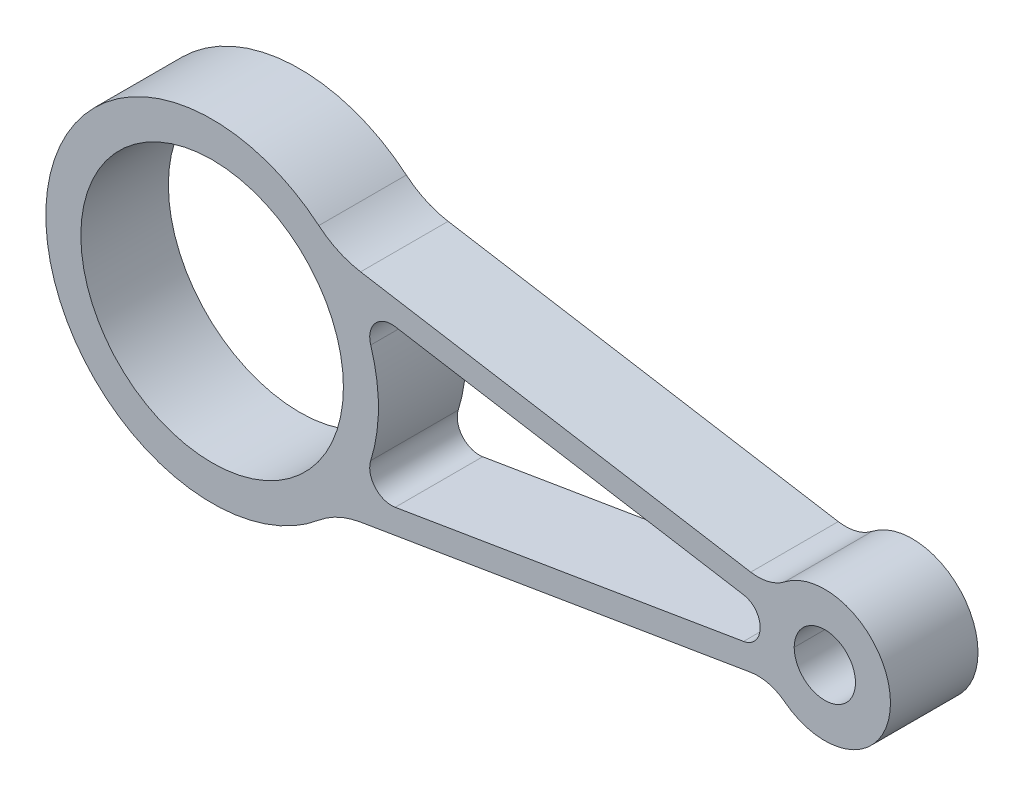
ISO-10303-21;
HEADER;
FILE_DESCRIPTION(('STEP AP214'),'2;1');
FILE_NAME('part.step','',(''),(''),'','','');
FILE_SCHEMA(('AUTOMOTIVE_DESIGN { 1 0 10303 214 1 1 1 1 }'));
ENDSEC;
DATA;
#1=APPLICATION_CONTEXT('core data for automotive mechanical design processes');
#2=APPLICATION_PROTOCOL_DEFINITION('international standard','automotive_design',2000,#1);
#3=PRODUCT_CONTEXT('',#1,'mechanical');
#4=PRODUCT('Part','Part','',(#3));
#5=PRODUCT_RELATED_PRODUCT_CATEGORY('part','',(#4));
#6=PRODUCT_DEFINITION_FORMATION('','',#4);
#7=PRODUCT_DEFINITION_CONTEXT('part definition',#1,'design');
#8=PRODUCT_DEFINITION('design','',#6,#7);
#9=PRODUCT_DEFINITION_SHAPE('','',#8);
#10=(LENGTH_UNIT() NAMED_UNIT(*) SI_UNIT(.MILLI.,.METRE.));
#11=(NAMED_UNIT(*) PLANE_ANGLE_UNIT() SI_UNIT($,.RADIAN.));
#12=(NAMED_UNIT(*) SI_UNIT($,.STERADIAN.) SOLID_ANGLE_UNIT());
#13=UNCERTAINTY_MEASURE_WITH_UNIT(LENGTH_MEASURE(1.E-05),#10,'distance_accuracy_value','');
#14=(GEOMETRIC_REPRESENTATION_CONTEXT(3) GLOBAL_UNCERTAINTY_ASSIGNED_CONTEXT((#13)) GLOBAL_UNIT_ASSIGNED_CONTEXT((#10,
#11,#12)) REPRESENTATION_CONTEXT('',''));
#15=CARTESIAN_POINT('',(0.,0.,0.));
#16=DIRECTION('',(0.,0.,1.));
#17=DIRECTION('',(1.,0.,0.));
#18=AXIS2_PLACEMENT_3D('',#15,#16,#17);
#19=CARTESIAN_POINT('',(140.,0.,-20.));
#20=DIRECTION('',(0.,0.,1.));
#21=DIRECTION('',(1.,0.,0.));
#22=AXIS2_PLACEMENT_3D('',#19,#20,#21);
#23=CYLINDRICAL_SURFACE('',#22,7.00000000000001);
#24=CARTESIAN_POINT('',(140.,0.,-20.));
#25=DIRECTION('',(0.,0.,1.));
#26=DIRECTION('',(1.,0.,0.));
#27=AXIS2_PLACEMENT_3D('',#24,#25,#26);
#28=CIRCLE('',#27,7.00000000000001);
#29=CARTESIAN_POINT('',(133.,0.,-20.));
#30=VERTEX_POINT('',#29);
#31=CARTESIAN_POINT('',(147.,0.,-20.));
#32=VERTEX_POINT('',#31);
#33=EDGE_CURVE('E226',#30,#32,#28,.T.);
#34=ORIENTED_EDGE('',*,*,#33,.F.);
#35=DIRECTION('',(0.,0.,1.));
#36=VECTOR('',#35,1.);
#37=CARTESIAN_POINT('',(133.,0.,-20.));
#38=LINE('',#37,#36);
#39=CARTESIAN_POINT('',(133.,0.,0.));
#40=VERTEX_POINT('',#39);
#41=EDGE_CURVE('E11',#30,#40,#38,.T.);
#42=ORIENTED_EDGE('',*,*,#41,.T.);
#43=CARTESIAN_POINT('',(140.,0.,0.));
#44=DIRECTION('',(0.,0.,1.));
#45=DIRECTION('',(1.,0.,0.));
#46=AXIS2_PLACEMENT_3D('',#43,#44,#45);
#47=CIRCLE('',#46,7.00000000000001);
#48=CARTESIAN_POINT('',(147.,0.,0.));
#49=VERTEX_POINT('',#48);
#50=EDGE_CURVE('E215',#40,#49,#47,.T.);
#51=ORIENTED_EDGE('',*,*,#50,.T.);
#52=DIRECTION('',(0.,0.,-1.));
#53=VECTOR('',#52,1.);
#54=CARTESIAN_POINT('',(147.,0.,-20.));
#55=LINE('',#54,#53);
#56=EDGE_CURVE('E46',#49,#32,#55,.T.);
#57=ORIENTED_EDGE('',*,*,#56,.T.);
#58=EDGE_LOOP('',(#34,#42,#51,#57));
#59=FACE_BOUND('',#58,.T.);
#60=ADVANCED_FACE('F37',(#59),#23,.F.);
#61=CARTESIAN_POINT('',(0.,0.,-20.));
#62=DIRECTION('',(0.,0.,1.));
#63=DIRECTION('',(1.,0.,0.));
#64=AXIS2_PLACEMENT_3D('',#61,#62,#63);
#65=CYLINDRICAL_SURFACE('',#64,38.);
#66=CARTESIAN_POINT('',(0.,0.,0.));
#67=DIRECTION('',(0.,0.,1.));
#68=DIRECTION('',(1.,0.,0.));
#69=AXIS2_PLACEMENT_3D('',#66,#67,#68);
#70=CIRCLE('',#69,38.);
#71=CARTESIAN_POINT('',(24.3781675337846,29.1496989297442,0.));
#72=VERTEX_POINT('',#71);
#73=CARTESIAN_POINT('',(24.3781675337846,-29.1496989297442,0.));
#74=VERTEX_POINT('',#73);
#75=EDGE_CURVE('E232',#72,#74,#70,.T.);
#76=ORIENTED_EDGE('',*,*,#75,.F.);
#77=DIRECTION('',(0.,0.,1.));
#78=VECTOR('',#77,1.);
#79=CARTESIAN_POINT('',(24.3781675337846,29.1496989297442,-20.));
#80=LINE('',#79,#78);
#81=CARTESIAN_POINT('',(24.3781675337846,29.1496989297442,-20.));
#82=VERTEX_POINT('',#81);
#83=EDGE_CURVE('E281',#72,#82,#80,.F.);
#84=ORIENTED_EDGE('',*,*,#83,.T.);
#85=CARTESIAN_POINT('',(0.,0.,-20.));
#86=DIRECTION('',(0.,0.,1.));
#87=DIRECTION('',(1.,0.,0.));
#88=AXIS2_PLACEMENT_3D('',#85,#86,#87);
#89=CIRCLE('',#88,38.);
#90=CARTESIAN_POINT('',(24.3781675337846,-29.1496989297442,-20.));
#91=VERTEX_POINT('',#90);
#92=EDGE_CURVE('E235',#82,#91,#89,.T.);
#93=ORIENTED_EDGE('',*,*,#92,.T.);
#94=DIRECTION('',(0.,0.,1.));
#95=VECTOR('',#94,1.);
#96=CARTESIAN_POINT('',(24.3781675337846,-29.1496989297442,-20.));
#97=LINE('',#96,#95);
#98=EDGE_CURVE('E278',#91,#74,#97,.T.);
#99=ORIENTED_EDGE('',*,*,#98,.T.);
#100=EDGE_LOOP('',(#76,#84,#93,#99));
#101=FACE_BOUND('',#100,.T.);
#102=ADVANCED_FACE('F343',(#101),#65,.T.);
#103=CARTESIAN_POINT('',(27.9354736759495,25.7606154914888,-20.));
#104=DIRECTION('',(0.164285714285714,0.986412795984335,0.));
#105=DIRECTION('',(-0.986412795984335,0.164285714285714,0.));
#106=AXIS2_PLACEMENT_3D('',#103,#104,#105);
#107=PLANE('',#106);
#108=DIRECTION('',(-0.986412795984335,0.164285714285714,0.));
#109=VECTOR('',#108,1.);
#110=CARTESIAN_POINT('',(27.9354736759495,25.7606154914888,-20.));
#111=LINE('',#110,#109);
#112=CARTESIAN_POINT('',(123.068754783715,9.91629645714704,-20.));
#113=VERTEX_POINT('',#112);
#114=CARTESIAN_POINT('',(33.9230677395358,24.7633898151861,-20.));
#115=VERTEX_POINT('',#114);
#116=EDGE_CURVE('E244',#113,#115,#111,.T.);
#117=ORIENTED_EDGE('',*,*,#116,.T.);
#118=DIRECTION('',(0.,0.,-1.));
#119=VECTOR('',#118,1.);
#120=CARTESIAN_POINT('',(33.9230677395358,24.7633898151861,0.));
#121=LINE('',#120,#119);
#122=CARTESIAN_POINT('',(33.9230677395358,24.7633898151861,0.));
#123=VERTEX_POINT('',#122);
#124=EDGE_CURVE('E275',#115,#123,#121,.F.);
#125=ORIENTED_EDGE('',*,*,#124,.T.);
#126=DIRECTION('',(-0.986412795984335,0.164285714285714,0.));
#127=VECTOR('',#126,1.);
#128=CARTESIAN_POINT('',(27.9354736759495,25.7606154914888,0.));
#129=LINE('',#128,#127);
#130=CARTESIAN_POINT('',(123.068754783715,9.91629645714704,0.));
#131=VERTEX_POINT('',#130);
#132=EDGE_CURVE('E239',#131,#123,#129,.T.);
#133=ORIENTED_EDGE('',*,*,#132,.F.);
#134=DIRECTION('',(0.,0.,-1.));
#135=VECTOR('',#134,1.);
#136=CARTESIAN_POINT('',(123.068754783715,9.91629645714704,-20.));
#137=LINE('',#136,#135);
#138=EDGE_CURVE('E261',#131,#113,#137,.T.);
#139=ORIENTED_EDGE('',*,*,#138,.T.);
#140=EDGE_LOOP('',(#117,#125,#133,#139));
#141=FACE_BOUND('',#140,.T.);
#142=ADVANCED_FACE('F321',(#141),#107,.T.);
#143=CARTESIAN_POINT('',(140.,0.,-20.));
#144=DIRECTION('',(0.,0.,1.));
#145=DIRECTION('',(1.,0.,0.));
#146=AXIS2_PLACEMENT_3D('',#143,#144,#145);
#147=CYLINDRICAL_SURFACE('',#146,15.);
#148=CARTESIAN_POINT('',(140.,0.,-20.));
#149=DIRECTION('',(0.,0.,1.));
#150=DIRECTION('',(1.,0.,0.));
#151=AXIS2_PLACEMENT_3D('',#148,#149,#150);
#152=CIRCLE('',#151,15.);
#153=CARTESIAN_POINT('',(130.826967155943,-11.8682546501942,-20.));
#154=VERTEX_POINT('',#153);
#155=CARTESIAN_POINT('',(130.826967155943,11.8682546501942,-20.));
#156=VERTEX_POINT('',#155);
#157=EDGE_CURVE('E241',#154,#156,#152,.T.);
#158=ORIENTED_EDGE('',*,*,#157,.T.);
#159=DIRECTION('',(0.,0.,1.));
#160=VECTOR('',#159,1.);
#161=CARTESIAN_POINT('',(130.826967155943,11.8682546501942,-20.));
#162=LINE('',#161,#160);
#163=CARTESIAN_POINT('',(130.826967155943,11.8682546501942,0.));
#164=VERTEX_POINT('',#163);
#165=EDGE_CURVE('E258',#156,#164,#162,.T.);
#166=ORIENTED_EDGE('',*,*,#165,.T.);
#167=CARTESIAN_POINT('',(140.,0.,0.));
#168=DIRECTION('',(0.,0.,1.));
#169=DIRECTION('',(1.,0.,0.));
#170=AXIS2_PLACEMENT_3D('',#167,#168,#169);
#171=CIRCLE('',#170,15.);
#172=CARTESIAN_POINT('',(130.826967155943,-11.8682546501942,0.));
#173=VERTEX_POINT('',#172);
#174=EDGE_CURVE('E252',#173,#164,#171,.T.);
#175=ORIENTED_EDGE('',*,*,#174,.F.);
#176=DIRECTION('',(0.,0.,1.));
#177=VECTOR('',#176,1.);
#178=CARTESIAN_POINT('',(130.826967155943,-11.8682546501942,-20.));
#179=LINE('',#178,#177);
#180=EDGE_CURVE('E247',#173,#154,#179,.F.);
#181=ORIENTED_EDGE('',*,*,#180,.T.);
#182=EDGE_LOOP('',(#158,#166,#175,#181));
#183=FACE_BOUND('',#182,.T.);
#184=ADVANCED_FACE('F331',(#183),#147,.T.);
#185=CARTESIAN_POINT('',(27.9354736759495,-25.7606154914888,-20.));
#186=DIRECTION('',(0.164285714285714,-0.986412795984335,0.));
#187=DIRECTION('',(0.986412795984335,0.164285714285714,0.));
#188=AXIS2_PLACEMENT_3D('',#185,#186,#187);
#189=PLANE('',#188);
#190=DIRECTION('',(0.986412795984335,0.164285714285714,0.));
#191=VECTOR('',#190,1.);
#192=CARTESIAN_POINT('',(27.9354736759495,-25.7606154914888,0.));
#193=LINE('',#192,#191);
#194=CARTESIAN_POINT('',(33.9230677395358,-24.7633898151861,0.));
#195=VERTEX_POINT('',#194);
#196=CARTESIAN_POINT('',(123.068754783715,-9.91629645714704,0.));
#197=VERTEX_POINT('',#196);
#198=EDGE_CURVE('E250',#195,#197,#193,.T.);
#199=ORIENTED_EDGE('',*,*,#198,.F.);
#200=DIRECTION('',(0.,0.,-1.));
#201=VECTOR('',#200,1.);
#202=CARTESIAN_POINT('',(33.9230677395358,-24.7633898151861,-20.));
#203=LINE('',#202,#201);
#204=CARTESIAN_POINT('',(33.9230677395358,-24.7633898151861,-20.));
#205=VERTEX_POINT('',#204);
#206=EDGE_CURVE('E283',#195,#205,#203,.T.);
#207=ORIENTED_EDGE('',*,*,#206,.T.);
#208=DIRECTION('',(0.986412795984335,0.164285714285714,0.));
#209=VECTOR('',#208,1.);
#210=CARTESIAN_POINT('',(27.9354736759495,-25.7606154914888,-20.));
#211=LINE('',#210,#209);
#212=CARTESIAN_POINT('',(123.068754783715,-9.91629645714704,-20.));
#213=VERTEX_POINT('',#212);
#214=EDGE_CURVE('E238',#205,#213,#211,.T.);
#215=ORIENTED_EDGE('',*,*,#214,.T.);
#216=DIRECTION('',(0.,0.,-1.));
#217=VECTOR('',#216,1.);
#218=CARTESIAN_POINT('',(123.068754783715,-9.91629645714704,0.));
#219=LINE('',#218,#217);
#220=EDGE_CURVE('E263',#213,#197,#219,.F.);
#221=ORIENTED_EDGE('',*,*,#220,.T.);
#222=EDGE_LOOP('',(#199,#207,#215,#221));
#223=FACE_BOUND('',#222,.T.);
#224=ADVANCED_FACE('F303',(#223),#189,.T.);
#225=CARTESIAN_POINT('',(0.,0.,-20.));
#226=DIRECTION('',(0.,0.,1.));
#227=DIRECTION('',(1.,0.,0.));
#228=AXIS2_PLACEMENT_3D('',#225,#226,#227);
#229=PLANE('',#228);
#230=DIRECTION('',(0.986412795984335,-0.164285714285714,0.));
#231=VECTOR('',#230,1.);
#232=CARTESIAN_POINT('',(121.445609230919,4.61087017438385,-20.));
#233=LINE('',#232,#231);
#234=CARTESIAN_POINT('',(41.8285545583335,17.8709827250915,-20.));
#235=VERTEX_POINT('',#234);
#236=CARTESIAN_POINT('',(121.445609230919,4.61087017438385,-20.));
#237=VERTEX_POINT('',#236);
#238=EDGE_CURVE('E172',#235,#237,#233,.T.);
#239=ORIENTED_EDGE('',*,*,#238,.F.);
#240=CARTESIAN_POINT('',(41.0071259869049,12.9389187451698,-20.));
#241=DIRECTION('',(0.,0.,-1.));
#242=DIRECTION('',(1.,0.,0.));
#243=AXIS2_PLACEMENT_3D('',#240,#241,#242);
#244=CIRCLE('',#243,5.);
#245=CARTESIAN_POINT('',(36.2388555233113,11.4343933096849,-20.));
#246=VERTEX_POINT('',#245);
#247=EDGE_CURVE('E188',#246,#235,#244,.T.);
#248=ORIENTED_EDGE('',*,*,#247,.F.);
#249=CARTESIAN_POINT('',(0.,0.,-20.));
#250=DIRECTION('',(0.,0.,1.));
#251=DIRECTION('',(-1.,0.,0.));
#252=AXIS2_PLACEMENT_3D('',#249,#250,#251);
#253=CIRCLE('',#252,38.);
#254=CARTESIAN_POINT('',(36.2388555233113,-11.4343933096849,-20.));
#255=VERTEX_POINT('',#254);
#256=EDGE_CURVE('E181',#255,#246,#253,.T.);
#257=ORIENTED_EDGE('',*,*,#256,.F.);
#258=CARTESIAN_POINT('',(41.0071259869049,-12.9389187451698,-20.));
#259=DIRECTION('',(0.,0.,-1.));
#260=DIRECTION('',(-1.,0.,0.));
#261=AXIS2_PLACEMENT_3D('',#258,#259,#260);
#262=CIRCLE('',#261,5.);
#263=CARTESIAN_POINT('',(41.8285545583335,-17.8709827250915,-20.));
#264=VERTEX_POINT('',#263);
#265=EDGE_CURVE('E185',#264,#255,#262,.T.);
#266=ORIENTED_EDGE('',*,*,#265,.F.);
#267=DIRECTION('',(-0.986412795984335,-0.164285714285714,0.));
#268=VECTOR('',#267,1.);
#269=CARTESIAN_POINT('',(121.433526351168,-4.61288256163042,-20.));
#270=LINE('',#269,#268);
#271=CARTESIAN_POINT('',(121.433526351168,-4.61288256163042,-20.));
#272=VERTEX_POINT('',#271);
#273=EDGE_CURVE('E197',#272,#264,#270,.T.);
#274=ORIENTED_EDGE('',*,*,#273,.F.);
#275=CARTESIAN_POINT('',(120.694240636883,-0.174024979700915,-20.));
#276=DIRECTION('',(0.,0.,-1.));
#277=DIRECTION('',(-1.,0.,0.));
#278=AXIS2_PLACEMENT_3D('',#275,#276,#277);
#279=CIRCLE('',#278,4.5);
#280=CARTESIAN_POINT('',(125.194211833788,-0.157924451151643,-20.));
#281=VERTEX_POINT('',#280);
#282=EDGE_CURVE('E194',#281,#272,#279,.T.);
#283=ORIENTED_EDGE('',*,*,#282,.F.);
#284=CARTESIAN_POINT('',(120.706323516633,0.172012592454348,-20.));
#285=DIRECTION('',(0.,0.,-1.));
#286=DIRECTION('',(1.,0.,0.));
#287=AXIS2_PLACEMENT_3D('',#284,#285,#286);
#288=CIRCLE('',#287,4.5);
#289=EDGE_CURVE('E192',#237,#281,#288,.T.);
#290=ORIENTED_EDGE('',*,*,#289,.F.);
#291=EDGE_LOOP('',(#239,#248,#257,#266,#274,#283,#290));
#292=FACE_BOUND('',#291,.T.);
#293=EDGE_CURVE('E222',#32,#30,#28,.T.);
#294=ORIENTED_EDGE('',*,*,#293,.T.);
#295=ORIENTED_EDGE('',*,*,#33,.T.);
#296=EDGE_LOOP('',(#294,#295));
#297=FACE_BOUND('',#296,.T.);
#298=CARTESIAN_POINT('',(0.,0.,-20.));
#299=DIRECTION('',(0.,0.,1.));
#300=DIRECTION('',(1.,0.,0.));
#301=AXIS2_PLACEMENT_3D('',#298,#299,#300);
#302=CIRCLE('',#301,30.);
#303=CARTESIAN_POINT('',(30.,0.,-20.));
#304=VERTEX_POINT('',#303);
#305=EDGE_CURVE('E229',#304,#304,#302,.T.);
#306=ORIENTED_EDGE('',*,*,#305,.T.);
#307=EDGE_LOOP('',(#306));
#308=FACE_BOUND('',#307,.T.);
#309=ORIENTED_EDGE('',*,*,#92,.F.);
#310=CARTESIAN_POINT('',(37.2087820252501,44.4916457348728,-20.));
#311=DIRECTION('',(0.,0.,1.));
#312=DIRECTION('',(1.,0.,0.));
#313=AXIS2_PLACEMENT_3D('',#310,#311,#312);
#314=CIRCLE('',#313,20.);
#315=EDGE_CURVE('E287',#82,#115,#314,.T.);
#316=ORIENTED_EDGE('',*,*,#315,.T.);
#317=ORIENTED_EDGE('',*,*,#116,.F.);
#318=CARTESIAN_POINT('',(124.711611926572,19.7804244169904,-20.));
#319=DIRECTION('',(0.,0.,1.));
#320=DIRECTION('',(1.,0.,0.));
#321=AXIS2_PLACEMENT_3D('',#318,#319,#320);
#322=CIRCLE('',#321,10.);
#323=EDGE_CURVE('E268',#113,#156,#322,.T.);
#324=ORIENTED_EDGE('',*,*,#323,.T.);
#325=ORIENTED_EDGE('',*,*,#157,.F.);
#326=CARTESIAN_POINT('',(124.711611926572,-19.7804244169904,-20.));
#327=DIRECTION('',(0.,0.,1.));
#328=DIRECTION('',(1.,0.,0.));
#329=AXIS2_PLACEMENT_3D('',#326,#327,#328);
#330=CIRCLE('',#329,10.);
#331=EDGE_CURVE('E272',#154,#213,#330,.T.);
#332=ORIENTED_EDGE('',*,*,#331,.T.);
#333=ORIENTED_EDGE('',*,*,#214,.F.);
#334=CARTESIAN_POINT('',(37.2087820252501,-44.4916457348728,-20.));
#335=DIRECTION('',(0.,0.,1.));
#336=DIRECTION('',(1.,0.,0.));
#337=AXIS2_PLACEMENT_3D('',#334,#335,#336);
#338=CIRCLE('',#337,20.);
#339=EDGE_CURVE('E291',#205,#91,#338,.T.);
#340=ORIENTED_EDGE('',*,*,#339,.T.);
#341=EDGE_LOOP('',(#309,#316,#317,#324,#325,#332,#333,#340));
#342=FACE_BOUND('',#341,.T.);
#343=ADVANCED_FACE('F300',(#292,#297,#308,#342),#229,.F.);
#344=CARTESIAN_POINT('',(0.,0.,0.));
#345=DIRECTION('',(0.,0.,1.));
#346=DIRECTION('',(1.,0.,0.));
#347=AXIS2_PLACEMENT_3D('',#344,#345,#346);
#348=PLANE('',#347);
#349=CARTESIAN_POINT('',(120.694240636883,-0.174024979700915,0.));
#350=DIRECTION('',(0.,0.,-1.));
#351=DIRECTION('',(-1.,0.,0.));
#352=AXIS2_PLACEMENT_3D('',#349,#350,#351);
#353=CIRCLE('',#352,4.5);
#354=CARTESIAN_POINT('',(125.194211833788,-0.157924451151643,0.));
#355=VERTEX_POINT('',#354);
#356=CARTESIAN_POINT('',(121.433526351168,-4.61288256163042,0.));
#357=VERTEX_POINT('',#356);
#358=EDGE_CURVE('E177',#355,#357,#353,.T.);
#359=ORIENTED_EDGE('',*,*,#358,.T.);
#360=DIRECTION('',(0.986412795984335,0.164285714285714,0.));
#361=VECTOR('',#360,1.);
#362=CARTESIAN_POINT('',(41.8285545583335,-17.8709827250915,0.));
#363=LINE('',#362,#361);
#364=CARTESIAN_POINT('',(41.8285545583335,-17.8709827250915,0.));
#365=VERTEX_POINT('',#364);
#366=EDGE_CURVE('E166',#365,#357,#363,.T.);
#367=ORIENTED_EDGE('',*,*,#366,.F.);
#368=CARTESIAN_POINT('',(41.0071259869049,-12.9389187451698,0.));
#369=DIRECTION('',(0.,0.,1.));
#370=DIRECTION('',(-1.,0.,0.));
#371=AXIS2_PLACEMENT_3D('',#368,#369,#370);
#372=CIRCLE('',#371,5.);
#373=CARTESIAN_POINT('',(36.2388555233113,-11.4343933096849,0.));
#374=VERTEX_POINT('',#373);
#375=EDGE_CURVE('E209',#374,#365,#372,.T.);
#376=ORIENTED_EDGE('',*,*,#375,.F.);
#377=CARTESIAN_POINT('',(0.,0.,0.));
#378=DIRECTION('',(0.,0.,-1.));
#379=DIRECTION('',(1.,0.,0.));
#380=AXIS2_PLACEMENT_3D('',#377,#378,#379);
#381=CIRCLE('',#380,38.);
#382=CARTESIAN_POINT('',(36.2388555233113,11.4343933096849,0.));
#383=VERTEX_POINT('',#382);
#384=EDGE_CURVE('E206',#383,#374,#381,.T.);
#385=ORIENTED_EDGE('',*,*,#384,.F.);
#386=CARTESIAN_POINT('',(41.0071259869049,12.9389187451698,0.));
#387=DIRECTION('',(0.,0.,1.));
#388=DIRECTION('',(-1.,0.,0.));
#389=AXIS2_PLACEMENT_3D('',#386,#387,#388);
#390=CIRCLE('',#389,5.);
#391=CARTESIAN_POINT('',(41.8285545583335,17.8709827250915,0.));
#392=VERTEX_POINT('',#391);
#393=EDGE_CURVE('E163',#392,#383,#390,.T.);
#394=ORIENTED_EDGE('',*,*,#393,.F.);
#395=DIRECTION('',(-0.986412795984335,0.164285714285714,0.));
#396=VECTOR('',#395,1.);
#397=CARTESIAN_POINT('',(41.8285545583335,17.8709827250915,0.));
#398=LINE('',#397,#396);
#399=CARTESIAN_POINT('',(121.445609230919,4.61087017438385,0.));
#400=VERTEX_POINT('',#399);
#401=EDGE_CURVE('E155',#400,#392,#398,.T.);
#402=ORIENTED_EDGE('',*,*,#401,.F.);
#403=CARTESIAN_POINT('',(120.706323516633,0.172012592454348,0.));
#404=DIRECTION('',(0.,0.,-1.));
#405=DIRECTION('',(1.,0.,0.));
#406=AXIS2_PLACEMENT_3D('',#403,#404,#405);
#407=CIRCLE('',#406,4.5);
#408=EDGE_CURVE('E161',#400,#355,#407,.T.);
#409=ORIENTED_EDGE('',*,*,#408,.T.);
#410=EDGE_LOOP('',(#359,#367,#376,#385,#394,#402,#409));
#411=FACE_BOUND('',#410,.T.);
#412=EDGE_CURVE('E227',#49,#40,#47,.T.);
#413=ORIENTED_EDGE('',*,*,#412,.F.);
#414=ORIENTED_EDGE('',*,*,#50,.F.);
#415=EDGE_LOOP('',(#413,#414));
#416=FACE_BOUND('',#415,.T.);
#417=CARTESIAN_POINT('',(0.,0.,0.));
#418=DIRECTION('',(0.,0.,1.));
#419=DIRECTION('',(1.,0.,0.));
#420=AXIS2_PLACEMENT_3D('',#417,#418,#419);
#421=CIRCLE('',#420,30.);
#422=CARTESIAN_POINT('',(30.,0.,0.));
#423=VERTEX_POINT('',#422);
#424=EDGE_CURVE('E225',#423,#423,#421,.T.);
#425=ORIENTED_EDGE('',*,*,#424,.F.);
#426=EDGE_LOOP('',(#425));
#427=FACE_BOUND('',#426,.T.);
#428=ORIENTED_EDGE('',*,*,#132,.T.);
#429=CARTESIAN_POINT('',(37.2087820252501,44.4916457348728,0.));
#430=DIRECTION('',(0.,0.,1.));
#431=DIRECTION('',(1.,0.,0.));
#432=AXIS2_PLACEMENT_3D('',#429,#430,#431);
#433=CIRCLE('',#432,20.);
#434=EDGE_CURVE('E285',#123,#72,#433,.F.);
#435=ORIENTED_EDGE('',*,*,#434,.T.);
#436=ORIENTED_EDGE('',*,*,#75,.T.);
#437=CARTESIAN_POINT('',(37.2087820252501,-44.4916457348728,0.));
#438=DIRECTION('',(0.,0.,1.));
#439=DIRECTION('',(1.,0.,0.));
#440=AXIS2_PLACEMENT_3D('',#437,#438,#439);
#441=CIRCLE('',#440,20.);
#442=EDGE_CURVE('E289',#74,#195,#441,.F.);
#443=ORIENTED_EDGE('',*,*,#442,.T.);
#444=ORIENTED_EDGE('',*,*,#198,.T.);
#445=CARTESIAN_POINT('',(124.711611926572,-19.7804244169904,0.));
#446=DIRECTION('',(0.,0.,1.));
#447=DIRECTION('',(1.,0.,0.));
#448=AXIS2_PLACEMENT_3D('',#445,#446,#447);
#449=CIRCLE('',#448,10.);
#450=EDGE_CURVE('E270',#197,#173,#449,.F.);
#451=ORIENTED_EDGE('',*,*,#450,.T.);
#452=ORIENTED_EDGE('',*,*,#174,.T.);
#453=CARTESIAN_POINT('',(124.711611926572,19.7804244169904,0.));
#454=DIRECTION('',(0.,0.,1.));
#455=DIRECTION('',(1.,0.,0.));
#456=AXIS2_PLACEMENT_3D('',#453,#454,#455);
#457=CIRCLE('',#456,10.);
#458=EDGE_CURVE('E266',#164,#131,#457,.F.);
#459=ORIENTED_EDGE('',*,*,#458,.T.);
#460=EDGE_LOOP('',(#428,#435,#436,#443,#444,#451,#452,#459));
#461=FACE_BOUND('',#460,.T.);
#462=ADVANCED_FACE('F158',(#411,#416,#427,#461),#348,.T.);
#463=CARTESIAN_POINT('',(0.,0.,-20.));
#464=DIRECTION('',(0.,0.,1.));
#465=DIRECTION('',(1.,0.,0.));
#466=AXIS2_PLACEMENT_3D('',#463,#464,#465);
#467=CYLINDRICAL_SURFACE('',#466,30.);
#468=ORIENTED_EDGE('',*,*,#305,.F.);
#469=EDGE_LOOP('',(#468));
#470=FACE_BOUND('',#469,.T.);
#471=ORIENTED_EDGE('',*,*,#424,.T.);
#472=EDGE_LOOP('',(#471));
#473=FACE_BOUND('',#472,.T.);
#474=ADVANCED_FACE('F378',(#470,#473),#467,.F.);
#475=ORIENTED_EDGE('',*,*,#41,.F.);
#476=ORIENTED_EDGE('',*,*,#293,.F.);
#477=ORIENTED_EDGE('',*,*,#56,.F.);
#478=ORIENTED_EDGE('',*,*,#412,.T.);
#479=EDGE_LOOP('',(#475,#476,#477,#478));
#480=FACE_BOUND('',#479,.T.);
#481=ADVANCED_FACE('F298',(#480),#23,.F.);
#482=CARTESIAN_POINT('',(124.711611926572,19.7804244169904,-20.));
#483=DIRECTION('',(0.,0.,1.));
#484=DIRECTION('',(1.,0.,0.));
#485=AXIS2_PLACEMENT_3D('',#482,#483,#484);
#486=CYLINDRICAL_SURFACE('',#485,10.);
#487=ORIENTED_EDGE('',*,*,#323,.F.);
#488=ORIENTED_EDGE('',*,*,#138,.F.);
#489=ORIENTED_EDGE('',*,*,#458,.F.);
#490=ORIENTED_EDGE('',*,*,#165,.F.);
#491=EDGE_LOOP('',(#487,#488,#489,#490));
#492=FACE_BOUND('',#491,.T.);
#493=ADVANCED_FACE('F329',(#492),#486,.F.);
#494=CARTESIAN_POINT('',(124.711611926572,-19.7804244169904,-20.));
#495=DIRECTION('',(0.,0.,1.));
#496=DIRECTION('',(1.,0.,0.));
#497=AXIS2_PLACEMENT_3D('',#494,#495,#496);
#498=CYLINDRICAL_SURFACE('',#497,10.);
#499=ORIENTED_EDGE('',*,*,#331,.F.);
#500=ORIENTED_EDGE('',*,*,#180,.F.);
#501=ORIENTED_EDGE('',*,*,#450,.F.);
#502=ORIENTED_EDGE('',*,*,#220,.F.);
#503=EDGE_LOOP('',(#499,#500,#501,#502));
#504=FACE_BOUND('',#503,.T.);
#505=ADVANCED_FACE('F337',(#504),#498,.F.);
#506=CARTESIAN_POINT('',(37.2087820252501,44.4916457348728,-20.));
#507=DIRECTION('',(0.,0.,1.));
#508=DIRECTION('',(1.,0.,0.));
#509=AXIS2_PLACEMENT_3D('',#506,#507,#508);
#510=CYLINDRICAL_SURFACE('',#509,20.);
#511=ORIENTED_EDGE('',*,*,#315,.F.);
#512=ORIENTED_EDGE('',*,*,#83,.F.);
#513=ORIENTED_EDGE('',*,*,#434,.F.);
#514=ORIENTED_EDGE('',*,*,#124,.F.);
#515=EDGE_LOOP('',(#511,#512,#513,#514));
#516=FACE_BOUND('',#515,.T.);
#517=ADVANCED_FACE('F318',(#516),#510,.F.);
#518=CARTESIAN_POINT('',(37.2087820252501,-44.4916457348728,-20.));
#519=DIRECTION('',(0.,0.,1.));
#520=DIRECTION('',(1.,0.,0.));
#521=AXIS2_PLACEMENT_3D('',#518,#519,#520);
#522=CYLINDRICAL_SURFACE('',#521,20.);
#523=ORIENTED_EDGE('',*,*,#339,.F.);
#524=ORIENTED_EDGE('',*,*,#206,.F.);
#525=ORIENTED_EDGE('',*,*,#442,.F.);
#526=ORIENTED_EDGE('',*,*,#98,.F.);
#527=EDGE_LOOP('',(#523,#524,#525,#526));
#528=FACE_BOUND('',#527,.T.);
#529=ADVANCED_FACE('F39',(#528),#522,.F.);
#530=CARTESIAN_POINT('',(41.0071259869049,12.9389187451698,-5.));
#531=DIRECTION('',(0.,0.,1.));
#532=DIRECTION('',(1.,0.,0.));
#533=AXIS2_PLACEMENT_3D('',#530,#531,#532);
#534=CYLINDRICAL_SURFACE('',#533,5.);
#535=ORIENTED_EDGE('',*,*,#393,.T.);
#536=DIRECTION('',(0.,0.,1.));
#537=VECTOR('',#536,1.);
#538=CARTESIAN_POINT('',(36.2388555233113,11.4343933096849,-5.));
#539=LINE('',#538,#537);
#540=EDGE_CURVE('E165',#246,#383,#539,.T.);
#541=ORIENTED_EDGE('',*,*,#540,.F.);
#542=ORIENTED_EDGE('',*,*,#247,.T.);
#543=DIRECTION('',(0.,0.,1.));
#544=VECTOR('',#543,1.);
#545=CARTESIAN_POINT('',(41.8285545583335,17.8709827250915,-5.));
#546=LINE('',#545,#544);
#547=EDGE_CURVE('E213',#235,#392,#546,.T.);
#548=ORIENTED_EDGE('',*,*,#547,.T.);
#549=EDGE_LOOP('',(#535,#541,#542,#548));
#550=FACE_BOUND('',#549,.T.);
#551=ADVANCED_FACE('F362',(#550),#534,.F.);
#552=CARTESIAN_POINT('',(41.8285545583335,17.8709827250915,-5.));
#553=DIRECTION('',(0.164285714285714,0.986412795984335,0.));
#554=DIRECTION('',(-0.986412795984335,0.164285714285714,0.));
#555=AXIS2_PLACEMENT_3D('',#552,#553,#554);
#556=PLANE('',#555);
#557=DIRECTION('',(0.,0.,-1.));
#558=VECTOR('',#557,1.);
#559=CARTESIAN_POINT('',(121.445609230919,4.61087017438385,0.));
#560=LINE('',#559,#558);
#561=EDGE_CURVE('E169',#400,#237,#560,.T.);
#562=ORIENTED_EDGE('',*,*,#561,.F.);
#563=ORIENTED_EDGE('',*,*,#401,.T.);
#564=ORIENTED_EDGE('',*,*,#547,.F.);
#565=ORIENTED_EDGE('',*,*,#238,.T.);
#566=EDGE_LOOP('',(#562,#563,#564,#565));
#567=FACE_BOUND('',#566,.T.);
#568=ADVANCED_FACE('F170',(#567),#556,.F.);
#569=CARTESIAN_POINT('',(41.8285545583335,-17.8709827250915,-5.));
#570=DIRECTION('',(0.164285714285714,-0.986412795984335,0.));
#571=DIRECTION('',(0.986412795984335,0.164285714285714,0.));
#572=AXIS2_PLACEMENT_3D('',#569,#570,#571);
#573=PLANE('',#572);
#574=ORIENTED_EDGE('',*,*,#366,.T.);
#575=DIRECTION('',(0.,0.,-1.));
#576=VECTOR('',#575,1.);
#577=CARTESIAN_POINT('',(121.433526351168,-4.61288256163042,0.));
#578=LINE('',#577,#576);
#579=EDGE_CURVE('E202',#357,#272,#578,.T.);
#580=ORIENTED_EDGE('',*,*,#579,.T.);
#581=ORIENTED_EDGE('',*,*,#273,.T.);
#582=DIRECTION('',(0.,0.,1.));
#583=VECTOR('',#582,1.);
#584=CARTESIAN_POINT('',(41.8285545583335,-17.8709827250915,-5.));
#585=LINE('',#584,#583);
#586=EDGE_CURVE('E216',#264,#365,#585,.T.);
#587=ORIENTED_EDGE('',*,*,#586,.T.);
#588=EDGE_LOOP('',(#574,#580,#581,#587));
#589=FACE_BOUND('',#588,.T.);
#590=ADVANCED_FACE('F371',(#589),#573,.F.);
#591=CARTESIAN_POINT('',(41.0071259869049,-12.9389187451698,-5.));
#592=DIRECTION('',(0.,0.,1.));
#593=DIRECTION('',(1.,0.,0.));
#594=AXIS2_PLACEMENT_3D('',#591,#592,#593);
#595=CYLINDRICAL_SURFACE('',#594,5.);
#596=ORIENTED_EDGE('',*,*,#375,.T.);
#597=ORIENTED_EDGE('',*,*,#586,.F.);
#598=ORIENTED_EDGE('',*,*,#265,.T.);
#599=DIRECTION('',(0.,0.,1.));
#600=VECTOR('',#599,1.);
#601=CARTESIAN_POINT('',(36.2388555233113,-11.4343933096849,-5.));
#602=LINE('',#601,#600);
#603=EDGE_CURVE('E218',#255,#374,#602,.T.);
#604=ORIENTED_EDGE('',*,*,#603,.T.);
#605=EDGE_LOOP('',(#596,#597,#598,#604));
#606=FACE_BOUND('',#605,.T.);
#607=ADVANCED_FACE('F470',(#606),#595,.F.);
#608=CARTESIAN_POINT('',(0.,0.,-5.));
#609=DIRECTION('',(0.,0.,1.));
#610=DIRECTION('',(1.,0.,0.));
#611=AXIS2_PLACEMENT_3D('',#608,#609,#610);
#612=CYLINDRICAL_SURFACE('',#611,38.);
#613=ORIENTED_EDGE('',*,*,#384,.T.);
#614=ORIENTED_EDGE('',*,*,#603,.F.);
#615=ORIENTED_EDGE('',*,*,#256,.T.);
#616=ORIENTED_EDGE('',*,*,#540,.T.);
#617=EDGE_LOOP('',(#613,#614,#615,#616));
#618=FACE_BOUND('',#617,.T.);
#619=ADVANCED_FACE('F374',(#618),#612,.T.);
#620=CARTESIAN_POINT('',(120.694240636883,-0.174024979700915,0.));
#621=DIRECTION('',(0.,0.,-1.));
#622=DIRECTION('',(-1.,0.,0.));
#623=AXIS2_PLACEMENT_3D('',#620,#621,#622);
#624=CYLINDRICAL_SURFACE('',#623,4.5);
#625=ORIENTED_EDGE('',*,*,#282,.T.);
#626=ORIENTED_EDGE('',*,*,#579,.F.);
#627=ORIENTED_EDGE('',*,*,#358,.F.);
#628=DIRECTION('',(0.,0.,-1.));
#629=VECTOR('',#628,1.);
#630=CARTESIAN_POINT('',(125.194211833788,-0.157924451151643,0.));
#631=LINE('',#630,#629);
#632=EDGE_CURVE('E176',#355,#281,#631,.T.);
#633=ORIENTED_EDGE('',*,*,#632,.T.);
#634=EDGE_LOOP('',(#625,#626,#627,#633));
#635=FACE_BOUND('',#634,.T.);
#636=ADVANCED_FACE('F488',(#635),#624,.F.);
#637=CARTESIAN_POINT('',(120.706323516633,0.172012592454348,0.));
#638=DIRECTION('',(0.,0.,-1.));
#639=DIRECTION('',(-1.,0.,0.));
#640=AXIS2_PLACEMENT_3D('',#637,#638,#639);
#641=CYLINDRICAL_SURFACE('',#640,4.5);
#642=ORIENTED_EDGE('',*,*,#289,.T.);
#643=ORIENTED_EDGE('',*,*,#632,.F.);
#644=ORIENTED_EDGE('',*,*,#408,.F.);
#645=ORIENTED_EDGE('',*,*,#561,.T.);
#646=EDGE_LOOP('',(#642,#643,#644,#645));
#647=FACE_BOUND('',#646,.T.);
#648=ADVANCED_FACE('F179',(#647),#641,.F.);
#649=CLOSED_SHELL('',(#60,#102,#142,#184,#224,#343,#462,#474,#481,#493,#505,#517,#529,#551,#568,
#590,#607,#619,#636,#648));
#650=MANIFOLD_SOLID_BREP('B2',#649);
#651=ADVANCED_BREP_SHAPE_REPRESENTATION('',(#18,#650),#14);
#652=SHAPE_DEFINITION_REPRESENTATION(#9,#651);
ENDSEC;
END-ISO-10303-21;
